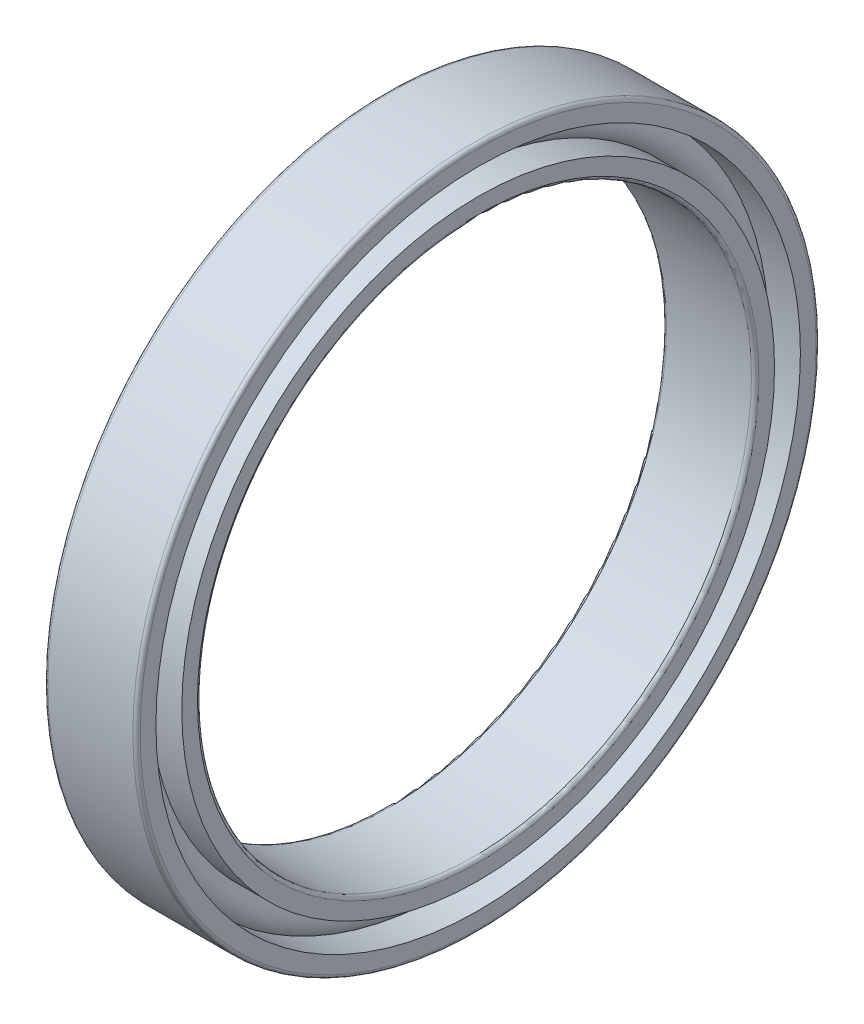
ISO-10303-21;
HEADER;
FILE_DESCRIPTION(('STEP AP214'),'2;1');
FILE_NAME('part.step','',(''),(''),'','','');
FILE_SCHEMA(('AUTOMOTIVE_DESIGN { 1 0 10303 214 1 1 1 1 }'));
ENDSEC;
DATA;
#1=APPLICATION_CONTEXT('core data for automotive mechanical design processes');
#2=APPLICATION_PROTOCOL_DEFINITION('international standard','automotive_design',2000,#1);
#3=PRODUCT_CONTEXT('',#1,'mechanical');
#4=PRODUCT('Part','Part','',(#3));
#5=PRODUCT_RELATED_PRODUCT_CATEGORY('part','',(#4));
#6=PRODUCT_DEFINITION_FORMATION('','',#4);
#7=PRODUCT_DEFINITION_CONTEXT('part definition',#1,'design');
#8=PRODUCT_DEFINITION('design','',#6,#7);
#9=PRODUCT_DEFINITION_SHAPE('','',#8);
#10=(LENGTH_UNIT() NAMED_UNIT(*) SI_UNIT(.MILLI.,.METRE.));
#11=(NAMED_UNIT(*) PLANE_ANGLE_UNIT() SI_UNIT($,.RADIAN.));
#12=(NAMED_UNIT(*) SI_UNIT($,.STERADIAN.) SOLID_ANGLE_UNIT());
#13=UNCERTAINTY_MEASURE_WITH_UNIT(LENGTH_MEASURE(1.E-05),#10,'distance_accuracy_value','');
#14=(GEOMETRIC_REPRESENTATION_CONTEXT(3) GLOBAL_UNCERTAINTY_ASSIGNED_CONTEXT((#13)) GLOBAL_UNIT_ASSIGNED_CONTEXT((#10,
#11,#12)) REPRESENTATION_CONTEXT('',''));
#15=CARTESIAN_POINT('',(0.,0.,0.));
#16=DIRECTION('',(0.,0.,1.));
#17=DIRECTION('',(1.,0.,0.));
#18=AXIS2_PLACEMENT_3D('',#15,#16,#17);
#19=CARTESIAN_POINT('',(0.,0.,0.));
#20=DIRECTION('',(-1.,0.,0.));
#21=DIRECTION('',(0.,0.,1.));
#22=AXIS2_PLACEMENT_3D('',#19,#20,#21);
#23=TOROIDAL_SURFACE('',#22,16.75,1.05);
#24=CARTESIAN_POINT('',(0.78262379212492,0.,0.));
#25=DIRECTION('',(-1.,0.,0.));
#26=DIRECTION('',(0.,0.,1.));
#27=AXIS2_PLACEMENT_3D('',#24,#25,#26);
#28=CIRCLE('',#27,17.45);
#29=CARTESIAN_POINT('',(0.78262379212492,0.,17.45));
#30=VERTEX_POINT('',#29);
#31=EDGE_CURVE('E45',#30,#30,#28,.F.);
#32=ORIENTED_EDGE('',*,*,#31,.T.);
#33=EDGE_LOOP('',(#32));
#34=FACE_BOUND('',#33,.T.);
#35=CARTESIAN_POINT('',(0.782623792124927,0.,0.));
#36=DIRECTION('',(-1.,0.,0.));
#37=DIRECTION('',(0.,0.,1.));
#38=AXIS2_PLACEMENT_3D('',#35,#36,#37);
#39=CIRCLE('',#38,16.05);
#40=CARTESIAN_POINT('',(0.782623792124927,0.,16.05));
#41=VERTEX_POINT('',#40);
#42=EDGE_CURVE('E10',#41,#41,#39,.T.);
#43=ORIENTED_EDGE('',*,*,#42,.T.);
#44=EDGE_LOOP('',(#43));
#45=FACE_BOUND('',#44,.T.);
#46=ADVANCED_FACE('F41',(#34,#45),#23,.T.);
#47=CARTESIAN_POINT('',(-20.6375,0.,0.));
#48=DIRECTION('',(1.,0.,0.));
#49=DIRECTION('',(0.,0.,-1.));
#50=AXIS2_PLACEMENT_3D('',#47,#48,#49);
#51=CYLINDRICAL_SURFACE('',#50,16.05);
#52=CARTESIAN_POINT('',(2.5,0.,0.));
#53=DIRECTION('',(1.,0.,0.));
#54=DIRECTION('',(0.,0.,-1.));
#55=AXIS2_PLACEMENT_3D('',#52,#53,#54);
#56=CIRCLE('',#55,16.05);
#57=CARTESIAN_POINT('',(2.5,0.,-16.05));
#58=VERTEX_POINT('',#57);
#59=EDGE_CURVE('E54',#58,#58,#56,.T.);
#60=ORIENTED_EDGE('',*,*,#59,.F.);
#61=EDGE_LOOP('',(#60));
#62=FACE_BOUND('',#61,.T.);
#63=ORIENTED_EDGE('',*,*,#42,.F.);
#64=EDGE_LOOP('',(#63));
#65=FACE_BOUND('',#64,.T.);
#66=ADVANCED_FACE('F93',(#62,#65),#51,.T.);
#67=CARTESIAN_POINT('',(-20.6375,0.,0.));
#68=DIRECTION('',(1.,0.,0.));
#69=DIRECTION('',(0.,0.,-1.));
#70=AXIS2_PLACEMENT_3D('',#67,#68,#69);
#71=CYLINDRICAL_SURFACE('',#70,16.05);
#72=CARTESIAN_POINT('',(-2.5,0.,0.));
#73=DIRECTION('',(1.,0.,0.));
#74=DIRECTION('',(0.,0.,-1.));
#75=AXIS2_PLACEMENT_3D('',#72,#73,#74);
#76=CIRCLE('',#75,16.05);
#77=CARTESIAN_POINT('',(-2.5,0.,-16.05));
#78=VERTEX_POINT('',#77);
#79=EDGE_CURVE('E63',#78,#78,#76,.T.);
#80=ORIENTED_EDGE('',*,*,#79,.T.);
#81=EDGE_LOOP('',(#80));
#82=FACE_BOUND('',#81,.T.);
#83=CARTESIAN_POINT('',(-0.782623792124927,0.,0.));
#84=DIRECTION('',(1.,0.,0.));
#85=DIRECTION('',(0.,0.,-1.));
#86=AXIS2_PLACEMENT_3D('',#83,#84,#85);
#87=CIRCLE('',#86,16.05);
#88=CARTESIAN_POINT('',(-0.782623792124927,0.,-16.05));
#89=VERTEX_POINT('',#88);
#90=EDGE_CURVE('E49',#89,#89,#87,.T.);
#91=ORIENTED_EDGE('',*,*,#90,.F.);
#92=EDGE_LOOP('',(#91));
#93=FACE_BOUND('',#92,.T.);
#94=ADVANCED_FACE('F96',(#82,#93),#71,.T.);
#95=CARTESIAN_POINT('',(2.5,15.2,0.));
#96=DIRECTION('',(1.,0.,0.));
#97=DIRECTION('',(0.,0.,-1.));
#98=AXIS2_PLACEMENT_3D('',#95,#96,#97);
#99=PLANE('',#98);
#100=ORIENTED_EDGE('',*,*,#59,.T.);
#101=EDGE_LOOP('',(#100));
#102=FACE_BOUND('',#101,.T.);
#103=CARTESIAN_POINT('',(2.5,0.,0.));
#104=DIRECTION('',(1.,0.,0.));
#105=DIRECTION('',(0.,0.,-1.));
#106=AXIS2_PLACEMENT_3D('',#103,#104,#105);
#107=CIRCLE('',#106,15.2);
#108=CARTESIAN_POINT('',(2.5,0.,-15.2));
#109=VERTEX_POINT('',#108);
#110=EDGE_CURVE('E85',#109,#109,#107,.T.);
#111=ORIENTED_EDGE('',*,*,#110,.F.);
#112=EDGE_LOOP('',(#111));
#113=FACE_BOUND('',#112,.T.);
#114=ADVANCED_FACE('F90',(#102,#113),#99,.T.);
#115=CARTESIAN_POINT('',(2.3,0.,0.));
#116=DIRECTION('',(1.,0.,0.));
#117=DIRECTION('',(0.,0.,-1.));
#118=AXIS2_PLACEMENT_3D('',#115,#116,#117);
#119=TOROIDAL_SURFACE('',#118,15.2,0.2);
#120=ORIENTED_EDGE('',*,*,#110,.T.);
#121=EDGE_LOOP('',(#120));
#122=FACE_BOUND('',#121,.T.);
#123=CARTESIAN_POINT('',(2.3,0.,0.));
#124=DIRECTION('',(1.,0.,0.));
#125=DIRECTION('',(0.,0.,-1.));
#126=AXIS2_PLACEMENT_3D('',#123,#124,#125);
#127=CIRCLE('',#126,15.);
#128=CARTESIAN_POINT('',(2.3,0.,-15.));
#129=VERTEX_POINT('',#128);
#130=EDGE_CURVE('E82',#129,#129,#127,.T.);
#131=ORIENTED_EDGE('',*,*,#130,.F.);
#132=EDGE_LOOP('',(#131));
#133=FACE_BOUND('',#132,.T.);
#134=ADVANCED_FACE('F107',(#122,#133),#119,.T.);
#135=CARTESIAN_POINT('',(-20.6375,0.,0.));
#136=DIRECTION('',(1.,0.,0.));
#137=DIRECTION('',(0.,0.,-1.));
#138=AXIS2_PLACEMENT_3D('',#135,#136,#137);
#139=CYLINDRICAL_SURFACE('',#138,15.);
#140=ORIENTED_EDGE('',*,*,#130,.T.);
#141=EDGE_LOOP('',(#140));
#142=FACE_BOUND('',#141,.T.);
#143=CARTESIAN_POINT('',(-2.3,0.,0.));
#144=DIRECTION('',(1.,0.,0.));
#145=DIRECTION('',(0.,0.,-1.));
#146=AXIS2_PLACEMENT_3D('',#143,#144,#145);
#147=CIRCLE('',#146,15.);
#148=CARTESIAN_POINT('',(-2.3,0.,-15.));
#149=VERTEX_POINT('',#148);
#150=EDGE_CURVE('E79',#149,#149,#147,.T.);
#151=ORIENTED_EDGE('',*,*,#150,.F.);
#152=EDGE_LOOP('',(#151));
#153=FACE_BOUND('',#152,.T.);
#154=ADVANCED_FACE('F110',(#142,#153),#139,.F.);
#155=CARTESIAN_POINT('',(-2.3,0.,0.));
#156=DIRECTION('',(1.,0.,0.));
#157=DIRECTION('',(0.,0.,-1.));
#158=AXIS2_PLACEMENT_3D('',#155,#156,#157);
#159=TOROIDAL_SURFACE('',#158,15.2,0.2);
#160=ORIENTED_EDGE('',*,*,#150,.T.);
#161=EDGE_LOOP('',(#160));
#162=FACE_BOUND('',#161,.T.);
#163=CARTESIAN_POINT('',(-2.5,0.,0.));
#164=DIRECTION('',(1.,0.,0.));
#165=DIRECTION('',(0.,0.,-1.));
#166=AXIS2_PLACEMENT_3D('',#163,#164,#165);
#167=CIRCLE('',#166,15.2);
#168=CARTESIAN_POINT('',(-2.5,0.,-15.2));
#169=VERTEX_POINT('',#168);
#170=EDGE_CURVE('E76',#169,#169,#167,.T.);
#171=ORIENTED_EDGE('',*,*,#170,.F.);
#172=EDGE_LOOP('',(#171));
#173=FACE_BOUND('',#172,.T.);
#174=ADVANCED_FACE('F114',(#162,#173),#159,.T.);
#175=CARTESIAN_POINT('',(-2.5,16.05,0.));
#176=DIRECTION('',(-1.,0.,0.));
#177=DIRECTION('',(0.,0.,1.));
#178=AXIS2_PLACEMENT_3D('',#175,#176,#177);
#179=PLANE('',#178);
#180=ORIENTED_EDGE('',*,*,#170,.T.);
#181=EDGE_LOOP('',(#180));
#182=FACE_BOUND('',#181,.T.);
#183=ORIENTED_EDGE('',*,*,#79,.F.);
#184=EDGE_LOOP('',(#183));
#185=FACE_BOUND('',#184,.T.);
#186=ADVANCED_FACE('F118',(#182,#185),#179,.T.);
#187=CARTESIAN_POINT('',(-0.78262379212492,0.,0.));
#188=DIRECTION('',(1.,0.,0.));
#189=DIRECTION('',(0.,0.,-1.));
#190=AXIS2_PLACEMENT_3D('',#187,#188,#189);
#191=CIRCLE('',#190,17.45);
#192=CARTESIAN_POINT('',(-0.78262379212492,0.,-17.45));
#193=VERTEX_POINT('',#192);
#194=EDGE_CURVE('E57',#193,#193,#191,.F.);
#195=ORIENTED_EDGE('',*,*,#194,.T.);
#196=EDGE_LOOP('',(#195));
#197=FACE_BOUND('',#196,.T.);
#198=ORIENTED_EDGE('',*,*,#90,.T.);
#199=EDGE_LOOP('',(#198));
#200=FACE_BOUND('',#199,.T.);
#201=ADVANCED_FACE('F43',(#197,#200),#23,.T.);
#202=CARTESIAN_POINT('',(-20.6375,0.,0.));
#203=DIRECTION('',(1.,0.,0.));
#204=DIRECTION('',(0.,0.,-1.));
#205=AXIS2_PLACEMENT_3D('',#202,#203,#204);
#206=CYLINDRICAL_SURFACE('',#205,17.45);
#207=CARTESIAN_POINT('',(2.5,0.,0.));
#208=DIRECTION('',(1.,0.,0.));
#209=DIRECTION('',(0.,0.,-1.));
#210=AXIS2_PLACEMENT_3D('',#207,#208,#209);
#211=CIRCLE('',#210,17.45);
#212=CARTESIAN_POINT('',(2.5,0.,-17.45));
#213=VERTEX_POINT('',#212);
#214=EDGE_CURVE('E59',#213,#213,#211,.T.);
#215=ORIENTED_EDGE('',*,*,#214,.T.);
#216=EDGE_LOOP('',(#215));
#217=FACE_BOUND('',#216,.T.);
#218=ORIENTED_EDGE('',*,*,#31,.F.);
#219=EDGE_LOOP('',(#218));
#220=FACE_BOUND('',#219,.T.);
#221=ADVANCED_FACE('F123',(#217,#220),#206,.F.);
#222=CARTESIAN_POINT('',(-20.6375,0.,0.));
#223=DIRECTION('',(1.,0.,0.));
#224=DIRECTION('',(0.,0.,-1.));
#225=AXIS2_PLACEMENT_3D('',#222,#223,#224);
#226=CYLINDRICAL_SURFACE('',#225,17.45);
#227=CARTESIAN_POINT('',(-2.5,0.,0.));
#228=DIRECTION('',(1.,0.,0.));
#229=DIRECTION('',(0.,0.,-1.));
#230=AXIS2_PLACEMENT_3D('',#227,#228,#229);
#231=CIRCLE('',#230,17.45);
#232=CARTESIAN_POINT('',(-2.5,0.,-17.45));
#233=VERTEX_POINT('',#232);
#234=EDGE_CURVE('E154',#233,#233,#231,.T.);
#235=ORIENTED_EDGE('',*,*,#234,.F.);
#236=EDGE_LOOP('',(#235));
#237=FACE_BOUND('',#236,.T.);
#238=ORIENTED_EDGE('',*,*,#194,.F.);
#239=EDGE_LOOP('',(#238));
#240=FACE_BOUND('',#239,.T.);
#241=ADVANCED_FACE('F126',(#237,#240),#226,.F.);
#242=CARTESIAN_POINT('',(2.5,18.3,0.));
#243=DIRECTION('',(1.,0.,0.));
#244=DIRECTION('',(0.,0.,-1.));
#245=AXIS2_PLACEMENT_3D('',#242,#243,#244);
#246=PLANE('',#245);
#247=CARTESIAN_POINT('',(2.5,0.,0.));
#248=DIRECTION('',(1.,0.,0.));
#249=DIRECTION('',(0.,0.,-1.));
#250=AXIS2_PLACEMENT_3D('',#247,#248,#249);
#251=CIRCLE('',#250,18.3);
#252=CARTESIAN_POINT('',(2.5,0.,-18.3));
#253=VERTEX_POINT('',#252);
#254=EDGE_CURVE('E65',#253,#253,#251,.T.);
#255=ORIENTED_EDGE('',*,*,#254,.T.);
#256=EDGE_LOOP('',(#255));
#257=FACE_BOUND('',#256,.T.);
#258=ORIENTED_EDGE('',*,*,#214,.F.);
#259=EDGE_LOOP('',(#258));
#260=FACE_BOUND('',#259,.T.);
#261=ADVANCED_FACE('F127',(#257,#260),#246,.T.);
#262=CARTESIAN_POINT('',(2.3,0.,0.));
#263=DIRECTION('',(1.,0.,0.));
#264=DIRECTION('',(0.,0.,-1.));
#265=AXIS2_PLACEMENT_3D('',#262,#263,#264);
#266=TOROIDAL_SURFACE('',#265,18.3,0.2);
#267=CARTESIAN_POINT('',(2.3,0.,0.));
#268=DIRECTION('',(1.,0.,0.));
#269=DIRECTION('',(0.,0.,-1.));
#270=AXIS2_PLACEMENT_3D('',#267,#268,#269);
#271=CIRCLE('',#270,18.5);
#272=CARTESIAN_POINT('',(2.3,0.,-18.5));
#273=VERTEX_POINT('',#272);
#274=EDGE_CURVE('E70',#273,#273,#271,.T.);
#275=ORIENTED_EDGE('',*,*,#274,.T.);
#276=EDGE_LOOP('',(#275));
#277=FACE_BOUND('',#276,.T.);
#278=ORIENTED_EDGE('',*,*,#254,.F.);
#279=EDGE_LOOP('',(#278));
#280=FACE_BOUND('',#279,.T.);
#281=ADVANCED_FACE('F130',(#277,#280),#266,.T.);
#282=CARTESIAN_POINT('',(-20.6375,0.,0.));
#283=DIRECTION('',(1.,0.,0.));
#284=DIRECTION('',(0.,0.,-1.));
#285=AXIS2_PLACEMENT_3D('',#282,#283,#284);
#286=CYLINDRICAL_SURFACE('',#285,18.5);
#287=CARTESIAN_POINT('',(-2.3,0.,0.));
#288=DIRECTION('',(1.,0.,0.));
#289=DIRECTION('',(0.,0.,-1.));
#290=AXIS2_PLACEMENT_3D('',#287,#288,#289);
#291=CIRCLE('',#290,18.5);
#292=CARTESIAN_POINT('',(-2.3,0.,-18.5));
#293=VERTEX_POINT('',#292);
#294=EDGE_CURVE('E158',#293,#293,#291,.T.);
#295=ORIENTED_EDGE('',*,*,#294,.T.);
#296=EDGE_LOOP('',(#295));
#297=FACE_BOUND('',#296,.T.);
#298=ORIENTED_EDGE('',*,*,#274,.F.);
#299=EDGE_LOOP('',(#298));
#300=FACE_BOUND('',#299,.T.);
#301=ADVANCED_FACE('F134',(#297,#300),#286,.T.);
#302=CARTESIAN_POINT('',(-2.3,0.,0.));
#303=DIRECTION('',(1.,0.,0.));
#304=DIRECTION('',(0.,0.,-1.));
#305=AXIS2_PLACEMENT_3D('',#302,#303,#304);
#306=TOROIDAL_SURFACE('',#305,18.3,0.2);
#307=CARTESIAN_POINT('',(-2.5,0.,0.));
#308=DIRECTION('',(1.,0.,0.));
#309=DIRECTION('',(0.,0.,-1.));
#310=AXIS2_PLACEMENT_3D('',#307,#308,#309);
#311=CIRCLE('',#310,18.3);
#312=CARTESIAN_POINT('',(-2.5,0.,-18.3));
#313=VERTEX_POINT('',#312);
#314=EDGE_CURVE('E155',#313,#313,#311,.T.);
#315=ORIENTED_EDGE('',*,*,#314,.T.);
#316=EDGE_LOOP('',(#315));
#317=FACE_BOUND('',#316,.T.);
#318=ORIENTED_EDGE('',*,*,#294,.F.);
#319=EDGE_LOOP('',(#318));
#320=FACE_BOUND('',#319,.T.);
#321=ADVANCED_FACE('F138',(#317,#320),#306,.T.);
#322=CARTESIAN_POINT('',(-2.5,17.45,0.));
#323=DIRECTION('',(-1.,0.,0.));
#324=DIRECTION('',(0.,0.,1.));
#325=AXIS2_PLACEMENT_3D('',#322,#323,#324);
#326=PLANE('',#325);
#327=ORIENTED_EDGE('',*,*,#234,.T.);
#328=EDGE_LOOP('',(#327));
#329=FACE_BOUND('',#328,.T.);
#330=ORIENTED_EDGE('',*,*,#314,.F.);
#331=EDGE_LOOP('',(#330));
#332=FACE_BOUND('',#331,.T.);
#333=ADVANCED_FACE('F142',(#329,#332),#326,.T.);
#334=CLOSED_SHELL('',(#46,#66,#94,#114,#134,#154,#174,#186,#201,#221,#241,#261,#281,#301,#321,#333));
#335=MANIFOLD_SOLID_BREP('B2',#334);
#336=ADVANCED_BREP_SHAPE_REPRESENTATION('',(#18,#335),#14);
#337=SHAPE_DEFINITION_REPRESENTATION(#9,#336);
ENDSEC;
END-ISO-10303-21;
